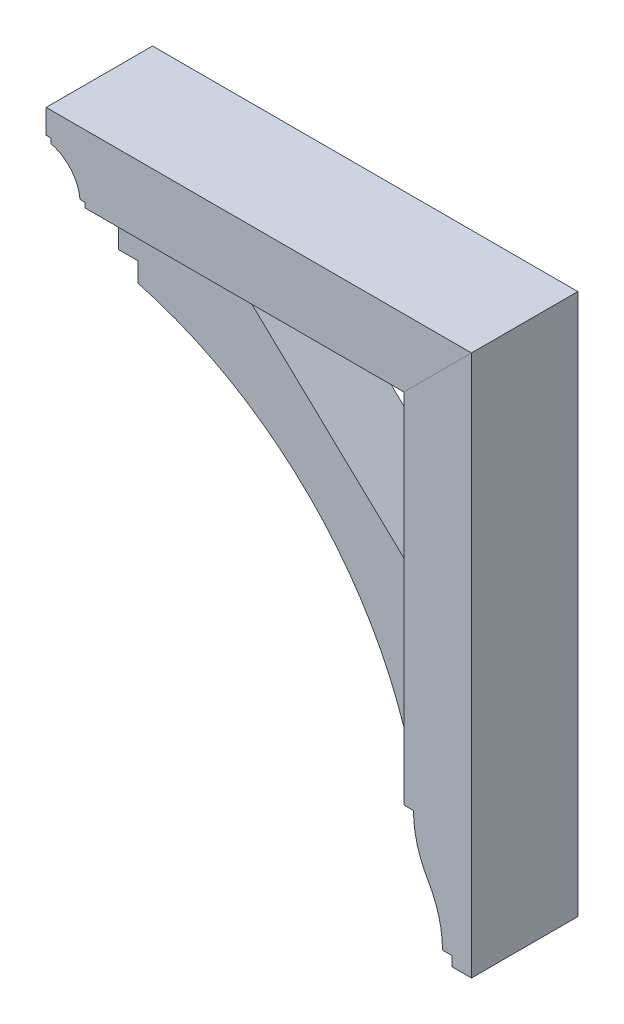
ISO-10303-21;
HEADER;
FILE_DESCRIPTION(('STEP AP214'),'2;1');
FILE_NAME('part.step','',(''),(''),'','','');
FILE_SCHEMA(('AUTOMOTIVE_DESIGN { 1 0 10303 214 1 1 1 1 }'));
ENDSEC;
DATA;
#1=APPLICATION_CONTEXT('core data for automotive mechanical design processes');
#2=APPLICATION_PROTOCOL_DEFINITION('international standard','automotive_design',2000,#1);
#3=PRODUCT_CONTEXT('',#1,'mechanical');
#4=PRODUCT('Part','Part','',(#3));
#5=PRODUCT_RELATED_PRODUCT_CATEGORY('part','',(#4));
#6=PRODUCT_DEFINITION_FORMATION('','',#4);
#7=PRODUCT_DEFINITION_CONTEXT('part definition',#1,'design');
#8=PRODUCT_DEFINITION('design','',#6,#7);
#9=PRODUCT_DEFINITION_SHAPE('','',#8);
#10=(LENGTH_UNIT() NAMED_UNIT(*) SI_UNIT(.MILLI.,.METRE.));
#11=(NAMED_UNIT(*) PLANE_ANGLE_UNIT() SI_UNIT($,.RADIAN.));
#12=(NAMED_UNIT(*) SI_UNIT($,.STERADIAN.) SOLID_ANGLE_UNIT());
#13=UNCERTAINTY_MEASURE_WITH_UNIT(LENGTH_MEASURE(1.E-05),#10,'distance_accuracy_value','');
#14=(GEOMETRIC_REPRESENTATION_CONTEXT(3) GLOBAL_UNCERTAINTY_ASSIGNED_CONTEXT((#13)) GLOBAL_UNIT_ASSIGNED_CONTEXT((#10,
#11,#12)) REPRESENTATION_CONTEXT('',''));
#15=CARTESIAN_POINT('',(0.,0.,0.));
#16=DIRECTION('',(0.,0.,1.));
#17=DIRECTION('',(1.,0.,0.));
#18=AXIS2_PLACEMENT_3D('',#15,#16,#17);
#19=CARTESIAN_POINT('',(384.591211656338,-183.515,69.85));
#20=DIRECTION('',(0.,0.,-1.));
#21=DIRECTION('',(-1.,0.,0.));
#22=AXIS2_PLACEMENT_3D('',#19,#20,#21);
#23=CYLINDRICAL_SURFACE('',#22,137.709988640782);
#24=CARTESIAN_POINT('',(384.591211656338,-183.515,-69.85));
#25=DIRECTION('',(0.,0.,1.));
#26=DIRECTION('',(1.,0.,0.));
#27=AXIS2_PLACEMENT_3D('',#24,#25,#26);
#28=CIRCLE('',#27,137.709988640782);
#29=CARTESIAN_POINT('',(265.948759904279,-253.429301925319,-69.85));
#30=VERTEX_POINT('',#29);
#31=CARTESIAN_POINT('',(246.881223015556,-183.515,-69.85));
#32=VERTEX_POINT('',#31);
#33=EDGE_CURVE('E150',#30,#32,#28,.F.);
#34=ORIENTED_EDGE('',*,*,#33,.F.);
#35=DIRECTION('',(0.,0.,-1.));
#36=VECTOR('',#35,1.);
#37=CARTESIAN_POINT('',(265.948759904279,-253.429301925319,69.85));
#38=LINE('',#37,#36);
#39=CARTESIAN_POINT('',(265.948759904279,-253.429301925319,69.85));
#40=VERTEX_POINT('',#39);
#41=EDGE_CURVE('E12',#40,#30,#38,.T.);
#42=ORIENTED_EDGE('',*,*,#41,.F.);
#43=CARTESIAN_POINT('',(384.591211656338,-183.515,69.85));
#44=DIRECTION('',(0.,0.,1.));
#45=DIRECTION('',(1.,0.,0.));
#46=AXIS2_PLACEMENT_3D('',#43,#44,#45);
#47=CIRCLE('',#46,137.709988640782);
#48=CARTESIAN_POINT('',(246.881223015556,-183.515,69.85));
#49=VERTEX_POINT('',#48);
#50=EDGE_CURVE('E171',#40,#49,#47,.F.);
#51=ORIENTED_EDGE('',*,*,#50,.T.);
#52=DIRECTION('',(0.,0.,-1.));
#53=VECTOR('',#52,1.);
#54=CARTESIAN_POINT('',(246.881223015556,-183.515,69.85));
#55=LINE('',#54,#53);
#56=EDGE_CURVE('E105',#49,#32,#55,.T.);
#57=ORIENTED_EDGE('',*,*,#56,.T.);
#58=EDGE_LOOP('',(#34,#42,#51,#57));
#59=FACE_BOUND('',#58,.T.);
#60=ADVANCED_FACE('F51',(#59),#23,.T.);
#61=CARTESIAN_POINT('',(147.524544989665,-323.215,69.85));
#62=DIRECTION('',(0.,0.,-1.));
#63=DIRECTION('',(-1.,0.,0.));
#64=AXIS2_PLACEMENT_3D('',#61,#62,#63);
#65=CYLINDRICAL_SURFACE('',#64,137.45667802589);
#66=CARTESIAN_POINT('',(147.524544989665,-323.215,-69.85));
#67=DIRECTION('',(0.,0.,1.));
#68=DIRECTION('',(1.,0.,0.));
#69=AXIS2_PLACEMENT_3D('',#66,#67,#68);
#70=CIRCLE('',#69,137.45667802589);
#71=CARTESIAN_POINT('',(284.981223015555,-323.215,-69.85));
#72=VERTEX_POINT('',#71);
#73=EDGE_CURVE('E153',#72,#30,#70,.T.);
#74=ORIENTED_EDGE('',*,*,#73,.F.);
#75=DIRECTION('',(0.,0.,-1.));
#76=VECTOR('',#75,1.);
#77=CARTESIAN_POINT('',(284.981223015555,-323.215,69.85));
#78=LINE('',#77,#76);
#79=CARTESIAN_POINT('',(284.981223015555,-323.215,69.85));
#80=VERTEX_POINT('',#79);
#81=EDGE_CURVE('E59',#80,#72,#78,.T.);
#82=ORIENTED_EDGE('',*,*,#81,.F.);
#83=CARTESIAN_POINT('',(147.524544989665,-323.215,69.85));
#84=DIRECTION('',(0.,0.,1.));
#85=DIRECTION('',(1.,0.,0.));
#86=AXIS2_PLACEMENT_3D('',#83,#84,#85);
#87=CIRCLE('',#86,137.45667802589);
#88=EDGE_CURVE('E202',#80,#40,#87,.T.);
#89=ORIENTED_EDGE('',*,*,#88,.T.);
#90=ORIENTED_EDGE('',*,*,#41,.T.);
#91=EDGE_LOOP('',(#74,#82,#89,#90));
#92=FACE_BOUND('',#91,.T.);
#93=ADVANCED_FACE('F190',(#92),#65,.F.);
#94=CARTESIAN_POINT('',(0.,-323.215,69.85));
#95=DIRECTION('',(0.,-1.,0.));
#96=DIRECTION('',(0.,0.,-1.));
#97=AXIS2_PLACEMENT_3D('',#94,#95,#96);
#98=PLANE('',#97);
#99=DIRECTION('',(-1.,0.,0.));
#100=VECTOR('',#99,1.);
#101=CARTESIAN_POINT('',(0.,-323.215,-69.85));
#102=LINE('',#101,#100);
#103=CARTESIAN_POINT('',(297.681223015555,-323.215,-69.85));
#104=VERTEX_POINT('',#103);
#105=EDGE_CURVE('E156',#104,#72,#102,.T.);
#106=ORIENTED_EDGE('',*,*,#105,.F.);
#107=DIRECTION('',(0.,0.,-1.));
#108=VECTOR('',#107,1.);
#109=CARTESIAN_POINT('',(297.681223015555,-323.215,69.85));
#110=LINE('',#109,#108);
#111=CARTESIAN_POINT('',(297.681223015555,-323.215,69.85));
#112=VERTEX_POINT('',#111);
#113=EDGE_CURVE('E179',#112,#104,#110,.T.);
#114=ORIENTED_EDGE('',*,*,#113,.F.);
#115=DIRECTION('',(-1.,0.,0.));
#116=VECTOR('',#115,1.);
#117=CARTESIAN_POINT('',(0.,-323.215,69.85));
#118=LINE('',#117,#116);
#119=EDGE_CURVE('E186',#112,#80,#118,.T.);
#120=ORIENTED_EDGE('',*,*,#119,.T.);
#121=ORIENTED_EDGE('',*,*,#81,.T.);
#122=EDGE_LOOP('',(#106,#114,#120,#121));
#123=FACE_BOUND('',#122,.T.);
#124=ADVANCED_FACE('F184',(#123),#98,.T.);
#125=CARTESIAN_POINT('',(297.681223015555,0.,69.85));
#126=DIRECTION('',(-1.,0.,0.));
#127=DIRECTION('',(0.,0.,1.));
#128=AXIS2_PLACEMENT_3D('',#125,#126,#127);
#129=PLANE('',#128);
#130=DIRECTION('',(0.,1.,0.));
#131=VECTOR('',#130,1.);
#132=CARTESIAN_POINT('',(297.681223015555,0.,-69.85));
#133=LINE('',#132,#131);
#134=CARTESIAN_POINT('',(297.681223015555,-335.915,-69.85));
#135=VERTEX_POINT('',#134);
#136=EDGE_CURVE('E159',#135,#104,#133,.T.);
#137=ORIENTED_EDGE('',*,*,#136,.F.);
#138=DIRECTION('',(0.,0.,-1.));
#139=VECTOR('',#138,1.);
#140=CARTESIAN_POINT('',(297.681223015555,-335.915,69.85));
#141=LINE('',#140,#139);
#142=CARTESIAN_POINT('',(297.681223015555,-335.915,69.85));
#143=VERTEX_POINT('',#142);
#144=EDGE_CURVE('E177',#143,#135,#141,.T.);
#145=ORIENTED_EDGE('',*,*,#144,.F.);
#146=DIRECTION('',(0.,1.,0.));
#147=VECTOR('',#146,1.);
#148=CARTESIAN_POINT('',(297.681223015555,0.,69.85));
#149=LINE('',#148,#147);
#150=EDGE_CURVE('E200',#143,#112,#149,.T.);
#151=ORIENTED_EDGE('',*,*,#150,.T.);
#152=ORIENTED_EDGE('',*,*,#113,.T.);
#153=EDGE_LOOP('',(#137,#145,#151,#152));
#154=FACE_BOUND('',#153,.T.);
#155=ADVANCED_FACE('F197',(#154),#129,.T.);
#156=CARTESIAN_POINT('',(-7.34134975033384E-13,-335.914999999999,69.85));
#157=DIRECTION('',(0.,-1.,0.));
#158=DIRECTION('',(1.,0.,0.));
#159=AXIS2_PLACEMENT_3D('',#156,#157,#158);
#160=PLANE('',#159);
#161=DIRECTION('',(-1.,0.,0.));
#162=VECTOR('',#161,1.);
#163=CARTESIAN_POINT('',(-7.34134975033384E-13,-335.914999999999,-69.85));
#164=LINE('',#163,#162);
#165=CARTESIAN_POINT('',(323.081223015555,-335.915,-69.85));
#166=VERTEX_POINT('',#165);
#167=EDGE_CURVE('E162',#166,#135,#164,.T.);
#168=ORIENTED_EDGE('',*,*,#167,.F.);
#169=DIRECTION('',(0.,0.,-1.));
#170=VECTOR('',#169,1.);
#171=CARTESIAN_POINT('',(323.081223015555,-335.915,69.85));
#172=LINE('',#171,#170);
#173=CARTESIAN_POINT('',(323.081223015555,-335.915,69.85));
#174=VERTEX_POINT('',#173);
#175=EDGE_CURVE('E175',#174,#166,#172,.T.);
#176=ORIENTED_EDGE('',*,*,#175,.F.);
#177=DIRECTION('',(-1.,0.,0.));
#178=VECTOR('',#177,1.);
#179=CARTESIAN_POINT('',(-7.34134975033384E-13,-335.914999999999,69.85));
#180=LINE('',#179,#178);
#181=EDGE_CURVE('E204',#174,#143,#180,.T.);
#182=ORIENTED_EDGE('',*,*,#181,.T.);
#183=ORIENTED_EDGE('',*,*,#144,.T.);
#184=EDGE_LOOP('',(#168,#176,#182,#183));
#185=FACE_BOUND('',#184,.T.);
#186=ADVANCED_FACE('F210',(#185),#160,.T.);
#187=CARTESIAN_POINT('',(323.081223015555,0.,69.85));
#188=DIRECTION('',(-1.,0.,0.));
#189=DIRECTION('',(0.,-1.,0.));
#190=AXIS2_PLACEMENT_3D('',#187,#188,#189);
#191=PLANE('',#190);
#192=DIRECTION('',(0.,1.,0.));
#193=VECTOR('',#192,1.);
#194=CARTESIAN_POINT('',(323.081223015555,0.,-69.85));
#195=LINE('',#194,#193);
#196=CARTESIAN_POINT('',(323.081223015555,375.285,-69.85));
#197=VERTEX_POINT('',#196);
#198=EDGE_CURVE('E165',#166,#197,#195,.T.);
#199=ORIENTED_EDGE('',*,*,#198,.T.);
#200=DIRECTION('',(0.,0.,-1.));
#201=VECTOR('',#200,1.);
#202=CARTESIAN_POINT('',(323.081223015555,375.285,69.85));
#203=LINE('',#202,#201);
#204=CARTESIAN_POINT('',(323.081223015555,375.285,69.85));
#205=VERTEX_POINT('',#204);
#206=EDGE_CURVE('E142',#205,#197,#203,.T.);
#207=ORIENTED_EDGE('',*,*,#206,.F.);
#208=DIRECTION('',(0.,1.,0.));
#209=VECTOR('',#208,1.);
#210=CARTESIAN_POINT('',(323.081223015555,0.,69.85));
#211=LINE('',#210,#209);
#212=EDGE_CURVE('E133',#174,#205,#211,.T.);
#213=ORIENTED_EDGE('',*,*,#212,.F.);
#214=ORIENTED_EDGE('',*,*,#175,.T.);
#215=EDGE_LOOP('',(#199,#207,#213,#214));
#216=FACE_BOUND('',#215,.T.);
#217=ADVANCED_FACE('F212',(#216),#191,.F.);
#218=CARTESIAN_POINT('',(-26.1018884922204,26.1018884922201,69.85));
#219=DIRECTION('',(0.707106781186552,-0.707106781186543,0.));
#220=DIRECTION('',(0.707106781186543,0.707106781186552,0.));
#221=AXIS2_PLACEMENT_3D('',#218,#219,#220);
#222=PLANE('',#221);
#223=DIRECTION('',(-0.707106781186543,-0.707106781186552,0.));
#224=VECTOR('',#223,1.);
#225=CARTESIAN_POINT('',(-26.1018884922204,26.1018884922201,-69.85));
#226=LINE('',#225,#224);
#227=CARTESIAN_POINT('',(234.181223015556,286.385,-69.85));
#228=VERTEX_POINT('',#227);
#229=EDGE_CURVE('E141',#197,#228,#226,.T.);
#230=ORIENTED_EDGE('',*,*,#229,.T.);
#231=DIRECTION('',(0.,0.,-1.));
#232=VECTOR('',#231,1.);
#233=CARTESIAN_POINT('',(234.181223015556,286.385,69.85));
#234=LINE('',#233,#232);
#235=CARTESIAN_POINT('',(234.181223015556,286.385,69.85));
#236=VERTEX_POINT('',#235);
#237=EDGE_CURVE('E138',#236,#228,#234,.T.);
#238=ORIENTED_EDGE('',*,*,#237,.F.);
#239=DIRECTION('',(-0.707106781186543,-0.707106781186552,0.));
#240=VECTOR('',#239,1.);
#241=CARTESIAN_POINT('',(-26.1018884922204,26.1018884922201,69.85));
#242=LINE('',#241,#240);
#243=EDGE_CURVE('E126',#205,#236,#242,.T.);
#244=ORIENTED_EDGE('',*,*,#243,.F.);
#245=ORIENTED_EDGE('',*,*,#206,.T.);
#246=EDGE_LOOP('',(#230,#238,#244,#245));
#247=FACE_BOUND('',#246,.T.);
#248=ADVANCED_FACE('F139',(#247),#222,.F.);
#249=CARTESIAN_POINT('',(234.181223015556,0.,69.85));
#250=DIRECTION('',(1.,0.,0.));
#251=DIRECTION('',(0.,1.,0.));
#252=AXIS2_PLACEMENT_3D('',#249,#250,#251);
#253=PLANE('',#252);
#254=DIRECTION('',(0.,-1.,0.));
#255=VECTOR('',#254,1.);
#256=CARTESIAN_POINT('',(234.181223015556,0.,-69.85));
#257=LINE('',#256,#255);
#258=CARTESIAN_POINT('',(234.181223015556,-183.515,-69.85));
#259=VERTEX_POINT('',#258);
#260=EDGE_CURVE('E98',#228,#259,#257,.T.);
#261=ORIENTED_EDGE('',*,*,#260,.T.);
#262=DIRECTION('',(0.,0.,-1.));
#263=VECTOR('',#262,1.);
#264=CARTESIAN_POINT('',(234.181223015556,-183.515,69.85));
#265=LINE('',#264,#263);
#266=CARTESIAN_POINT('',(234.181223015556,-183.515,69.85));
#267=VERTEX_POINT('',#266);
#268=EDGE_CURVE('E143',#267,#259,#265,.T.);
#269=ORIENTED_EDGE('',*,*,#268,.F.);
#270=DIRECTION('',(0.,-1.,0.));
#271=VECTOR('',#270,1.);
#272=CARTESIAN_POINT('',(234.181223015556,0.,69.85));
#273=LINE('',#272,#271);
#274=EDGE_CURVE('E130',#236,#267,#273,.T.);
#275=ORIENTED_EDGE('',*,*,#274,.F.);
#276=ORIENTED_EDGE('',*,*,#237,.T.);
#277=EDGE_LOOP('',(#261,#269,#275,#276));
#278=FACE_BOUND('',#277,.T.);
#279=ADVANCED_FACE('F145',(#278),#253,.F.);
#280=CARTESIAN_POINT('',(0.,-183.515,69.85));
#281=DIRECTION('',(0.,1.,0.));
#282=DIRECTION('',(0.,0.,1.));
#283=AXIS2_PLACEMENT_3D('',#280,#281,#282);
#284=PLANE('',#283);
#285=DIRECTION('',(1.,0.,0.));
#286=VECTOR('',#285,1.);
#287=CARTESIAN_POINT('',(0.,-183.515,-69.85));
#288=LINE('',#287,#286);
#289=EDGE_CURVE('E169',#259,#32,#288,.T.);
#290=ORIENTED_EDGE('',*,*,#289,.T.);
#291=ORIENTED_EDGE('',*,*,#56,.F.);
#292=DIRECTION('',(1.,0.,0.));
#293=VECTOR('',#292,1.);
#294=CARTESIAN_POINT('',(0.,-183.515,69.85));
#295=LINE('',#294,#293);
#296=EDGE_CURVE('E67',#267,#49,#295,.T.);
#297=ORIENTED_EDGE('',*,*,#296,.F.);
#298=ORIENTED_EDGE('',*,*,#268,.T.);
#299=EDGE_LOOP('',(#290,#291,#297,#298));
#300=FACE_BOUND('',#299,.T.);
#301=ADVANCED_FACE('F215',(#300),#284,.F.);
#302=CARTESIAN_POINT('',(0.,0.,69.85));
#303=DIRECTION('',(0.,0.,1.));
#304=DIRECTION('',(1.,0.,0.));
#305=AXIS2_PLACEMENT_3D('',#302,#303,#304);
#306=PLANE('',#305);
#307=ORIENTED_EDGE('',*,*,#50,.F.);
#308=ORIENTED_EDGE('',*,*,#88,.F.);
#309=ORIENTED_EDGE('',*,*,#119,.F.);
#310=ORIENTED_EDGE('',*,*,#150,.F.);
#311=ORIENTED_EDGE('',*,*,#181,.F.);
#312=ORIENTED_EDGE('',*,*,#212,.T.);
#313=ORIENTED_EDGE('',*,*,#243,.T.);
#314=ORIENTED_EDGE('',*,*,#274,.T.);
#315=ORIENTED_EDGE('',*,*,#296,.T.);
#316=EDGE_LOOP('',(#307,#308,#309,#310,#311,#312,#313,#314,#315));
#317=FACE_BOUND('',#316,.T.);
#318=ADVANCED_FACE('F128',(#317),#306,.T.);
#319=CARTESIAN_POINT('',(0.,0.,-69.85));
#320=DIRECTION('',(0.,0.,1.));
#321=DIRECTION('',(1.,0.,0.));
#322=AXIS2_PLACEMENT_3D('',#319,#320,#321);
#323=PLANE('',#322);
#324=ORIENTED_EDGE('',*,*,#33,.T.);
#325=ORIENTED_EDGE('',*,*,#289,.F.);
#326=ORIENTED_EDGE('',*,*,#260,.F.);
#327=ORIENTED_EDGE('',*,*,#229,.F.);
#328=ORIENTED_EDGE('',*,*,#198,.F.);
#329=ORIENTED_EDGE('',*,*,#167,.T.);
#330=ORIENTED_EDGE('',*,*,#136,.T.);
#331=ORIENTED_EDGE('',*,*,#105,.T.);
#332=ORIENTED_EDGE('',*,*,#73,.T.);
#333=EDGE_LOOP('',(#324,#325,#326,#327,#328,#329,#330,#331,#332));
#334=FACE_BOUND('',#333,.T.);
#335=ADVANCED_FACE('F192',(#334),#323,.F.);
#336=CLOSED_SHELL('',(#60,#93,#124,#155,#186,#217,#248,#279,#301,#318,#335));
#337=MANIFOLD_SOLID_BREP('B2',#336);
#338=CARTESIAN_POINT('',(-140.468776984445,0.,44.45));
#339=DIRECTION('',(1.,0.,0.));
#340=DIRECTION('',(0.,0.,-1.));
#341=AXIS2_PLACEMENT_3D('',#338,#339,#340);
#342=PLANE('',#341);
#343=DIRECTION('',(0.,-1.,0.));
#344=VECTOR('',#343,1.);
#345=CARTESIAN_POINT('',(-140.468776984445,0.,-44.45));
#346=LINE('',#345,#344);
#347=CARTESIAN_POINT('',(-140.468776984445,235.585,-44.45));
#348=VERTEX_POINT('',#347);
#349=CARTESIAN_POINT('',(-140.468776984445,210.185,-44.45));
#350=VERTEX_POINT('',#349);
#351=EDGE_CURVE('E411',#348,#350,#346,.T.);
#352=ORIENTED_EDGE('',*,*,#351,.T.);
#353=DIRECTION('',(0.,0.,-1.));
#354=VECTOR('',#353,1.);
#355=CARTESIAN_POINT('',(-140.468776984445,210.185,44.45));
#356=LINE('',#355,#354);
#357=CARTESIAN_POINT('',(-140.468776984445,210.185,44.45));
#358=VERTEX_POINT('',#357);
#359=EDGE_CURVE('E49',#358,#350,#356,.T.);
#360=ORIENTED_EDGE('',*,*,#359,.F.);
#361=DIRECTION('',(0.,-1.,0.));
#362=VECTOR('',#361,1.);
#363=CARTESIAN_POINT('',(-140.468776984445,0.,44.45));
#364=LINE('',#363,#362);
#365=CARTESIAN_POINT('',(-140.468776984445,235.585,44.45));
#366=VERTEX_POINT('',#365);
#367=EDGE_CURVE('E429',#366,#358,#364,.T.);
#368=ORIENTED_EDGE('',*,*,#367,.F.);
#369=DIRECTION('',(0.,0.,-1.));
#370=VECTOR('',#369,1.);
#371=CARTESIAN_POINT('',(-140.468776984445,235.585,44.45));
#372=LINE('',#371,#370);
#373=EDGE_CURVE('E410',#366,#348,#372,.T.);
#374=ORIENTED_EDGE('',*,*,#373,.T.);
#375=EDGE_LOOP('',(#352,#360,#368,#374));
#376=FACE_BOUND('',#375,.T.);
#377=ADVANCED_FACE('F313',(#376),#342,.F.);
#378=CARTESIAN_POINT('',(-273.3242381875,-280.134718580156,44.45));
#379=DIRECTION('',(0.,0.,-1.));
#380=DIRECTION('',(-1.,0.,0.));
#381=AXIS2_PLACEMENT_3D('',#378,#379,#380);
#382=CYLINDRICAL_SURFACE('',#381,508.);
#383=CARTESIAN_POINT('',(-273.3242381875,-280.134718580156,-44.45));
#384=DIRECTION('',(0.,0.,1.));
#385=DIRECTION('',(1.,0.,0.));
#386=AXIS2_PLACEMENT_3D('',#383,#384,#385);
#387=CIRCLE('',#386,508.);
#388=CARTESIAN_POINT('',(208.781223015556,-120.015,-44.45));
#389=VERTEX_POINT('',#388);
#390=EDGE_CURVE('E414',#350,#389,#387,.F.);
#391=ORIENTED_EDGE('',*,*,#390,.T.);
#392=DIRECTION('',(0.,0.,-1.));
#393=VECTOR('',#392,1.);
#394=CARTESIAN_POINT('',(208.781223015556,-120.015,44.45));
#395=LINE('',#394,#393);
#396=CARTESIAN_POINT('',(208.781223015556,-120.015,44.45));
#397=VERTEX_POINT('',#396);
#398=EDGE_CURVE('E321',#397,#389,#395,.T.);
#399=ORIENTED_EDGE('',*,*,#398,.F.);
#400=CARTESIAN_POINT('',(-273.3242381875,-280.134718580156,44.45));
#401=DIRECTION('',(0.,0.,1.));
#402=DIRECTION('',(1.,0.,0.));
#403=AXIS2_PLACEMENT_3D('',#400,#401,#402);
#404=CIRCLE('',#403,508.);
#405=EDGE_CURVE('E371',#358,#397,#404,.F.);
#406=ORIENTED_EDGE('',*,*,#405,.F.);
#407=ORIENTED_EDGE('',*,*,#359,.T.);
#408=EDGE_LOOP('',(#391,#399,#406,#407));
#409=FACE_BOUND('',#408,.T.);
#410=ADVANCED_FACE('F442',(#409),#382,.F.);
#411=CARTESIAN_POINT('',(0.,-120.015,44.45));
#412=DIRECTION('',(0.,-1.,0.));
#413=DIRECTION('',(0.,0.,-1.));
#414=AXIS2_PLACEMENT_3D('',#411,#412,#413);
#415=PLANE('',#414);
#416=DIRECTION('',(-1.,0.,0.));
#417=VECTOR('',#416,1.);
#418=CARTESIAN_POINT('',(0.,-120.015,-44.45));
#419=LINE('',#418,#417);
#420=CARTESIAN_POINT('',(234.181223015556,-120.015,-44.45));
#421=VERTEX_POINT('',#420);
#422=EDGE_CURVE('E417',#421,#389,#419,.T.);
#423=ORIENTED_EDGE('',*,*,#422,.F.);
#424=DIRECTION('',(0.,0.,-1.));
#425=VECTOR('',#424,1.);
#426=CARTESIAN_POINT('',(234.181223015556,-120.015,44.45));
#427=LINE('',#426,#425);
#428=CARTESIAN_POINT('',(234.181223015556,-120.015,44.45));
#429=VERTEX_POINT('',#428);
#430=EDGE_CURVE('E435',#429,#421,#427,.T.);
#431=ORIENTED_EDGE('',*,*,#430,.F.);
#432=DIRECTION('',(-1.,0.,0.));
#433=VECTOR('',#432,1.);
#434=CARTESIAN_POINT('',(0.,-120.015,44.45));
#435=LINE('',#434,#433);
#436=EDGE_CURVE('E441',#429,#397,#435,.T.);
#437=ORIENTED_EDGE('',*,*,#436,.T.);
#438=ORIENTED_EDGE('',*,*,#398,.T.);
#439=EDGE_LOOP('',(#423,#431,#437,#438));
#440=FACE_BOUND('',#439,.T.);
#441=ADVANCED_FACE('F439',(#440),#415,.T.);
#442=CARTESIAN_POINT('',(234.181223015556,0.,44.45));
#443=DIRECTION('',(1.,0.,0.));
#444=DIRECTION('',(0.,1.,0.));
#445=AXIS2_PLACEMENT_3D('',#442,#443,#444);
#446=PLANE('',#445);
#447=DIRECTION('',(0.,-1.,0.));
#448=VECTOR('',#447,1.);
#449=CARTESIAN_POINT('',(234.181223015556,0.,-44.45));
#450=LINE('',#449,#448);
#451=CARTESIAN_POINT('',(234.181223015556,48.22444,-44.45));
#452=VERTEX_POINT('',#451);
#453=EDGE_CURVE('E420',#452,#421,#450,.T.);
#454=ORIENTED_EDGE('',*,*,#453,.F.);
#455=DIRECTION('',(0.,0.,-1.));
#456=VECTOR('',#455,1.);
#457=CARTESIAN_POINT('',(234.181223015556,48.22444,44.45));
#458=LINE('',#457,#456);
#459=CARTESIAN_POINT('',(234.181223015556,48.22444,44.45));
#460=VERTEX_POINT('',#459);
#461=EDGE_CURVE('E433',#460,#452,#458,.T.);
#462=ORIENTED_EDGE('',*,*,#461,.F.);
#463=DIRECTION('',(0.,-1.,0.));
#464=VECTOR('',#463,1.);
#465=CARTESIAN_POINT('',(234.181223015556,0.,44.45));
#466=LINE('',#465,#464);
#467=EDGE_CURVE('E405',#460,#429,#466,.T.);
#468=ORIENTED_EDGE('',*,*,#467,.T.);
#469=ORIENTED_EDGE('',*,*,#430,.T.);
#470=EDGE_LOOP('',(#454,#462,#468,#469));
#471=FACE_BOUND('',#470,.T.);
#472=ADVANCED_FACE('F450',(#471),#446,.T.);
#473=CARTESIAN_POINT('',(134.603639858608,142.370007458488,44.45));
#474=DIRECTION('',(0.687009412845263,0.726648516589697,0.));
#475=DIRECTION('',(-0.726648516589697,0.687009412845263,0.));
#476=AXIS2_PLACEMENT_3D('',#473,#474,#475);
#477=PLANE('',#476);
#478=DIRECTION('',(0.726648516589697,-0.687009412845263,0.));
#479=VECTOR('',#478,1.);
#480=CARTESIAN_POINT('',(134.603639858608,142.370007458488,-44.45));
#481=LINE('',#480,#479);
#482=CARTESIAN_POINT('',(-17.7207369844447,286.385,-44.45));
#483=VERTEX_POINT('',#482);
#484=EDGE_CURVE('E423',#483,#452,#481,.T.);
#485=ORIENTED_EDGE('',*,*,#484,.F.);
#486=DIRECTION('',(0.,0.,-1.));
#487=VECTOR('',#486,1.);
#488=CARTESIAN_POINT('',(-17.7207369844447,286.385,44.45));
#489=LINE('',#488,#487);
#490=CARTESIAN_POINT('',(-17.7207369844447,286.385,44.45));
#491=VERTEX_POINT('',#490);
#492=EDGE_CURVE('E393',#491,#483,#489,.T.);
#493=ORIENTED_EDGE('',*,*,#492,.F.);
#494=DIRECTION('',(0.726648516589697,-0.687009412845263,0.));
#495=VECTOR('',#494,1.);
#496=CARTESIAN_POINT('',(134.603639858608,142.370007458488,44.45));
#497=LINE('',#496,#495);
#498=EDGE_CURVE('E403',#491,#460,#497,.T.);
#499=ORIENTED_EDGE('',*,*,#498,.T.);
#500=ORIENTED_EDGE('',*,*,#461,.T.);
#501=EDGE_LOOP('',(#485,#493,#499,#500));
#502=FACE_BOUND('',#501,.T.);
#503=ADVANCED_FACE('F478',(#502),#477,.T.);
#504=CARTESIAN_POINT('',(0.,286.385,44.45));
#505=DIRECTION('',(0.,1.,0.));
#506=DIRECTION('',(-1.,0.,0.));
#507=AXIS2_PLACEMENT_3D('',#504,#505,#506);
#508=PLANE('',#507);
#509=DIRECTION('',(1.,0.,0.));
#510=VECTOR('',#509,1.);
#511=CARTESIAN_POINT('',(0.,286.385,-44.45));
#512=LINE('',#511,#510);
#513=CARTESIAN_POINT('',(-165.868776984445,286.385,-44.45));
#514=VERTEX_POINT('',#513);
#515=EDGE_CURVE('E392',#514,#483,#512,.T.);
#516=ORIENTED_EDGE('',*,*,#515,.F.);
#517=DIRECTION('',(0.,0.,-1.));
#518=VECTOR('',#517,1.);
#519=CARTESIAN_POINT('',(-165.868776984445,286.385,44.45));
#520=LINE('',#519,#518);
#521=CARTESIAN_POINT('',(-165.868776984445,286.385,44.45));
#522=VERTEX_POINT('',#521);
#523=EDGE_CURVE('E386',#522,#514,#520,.T.);
#524=ORIENTED_EDGE('',*,*,#523,.F.);
#525=DIRECTION('',(1.,0.,0.));
#526=VECTOR('',#525,1.);
#527=CARTESIAN_POINT('',(0.,286.385,44.45));
#528=LINE('',#527,#526);
#529=EDGE_CURVE('E390',#522,#491,#528,.T.);
#530=ORIENTED_EDGE('',*,*,#529,.T.);
#531=ORIENTED_EDGE('',*,*,#492,.T.);
#532=EDGE_LOOP('',(#516,#524,#530,#531));
#533=FACE_BOUND('',#532,.T.);
#534=ADVANCED_FACE('F388',(#533),#508,.T.);
#535=CARTESIAN_POINT('',(-165.868776984445,0.,44.45));
#536=DIRECTION('',(1.,0.,0.));
#537=DIRECTION('',(0.,0.,-1.));
#538=AXIS2_PLACEMENT_3D('',#535,#536,#537);
#539=PLANE('',#538);
#540=DIRECTION('',(0.,-1.,0.));
#541=VECTOR('',#540,1.);
#542=CARTESIAN_POINT('',(-165.868776984445,0.,-44.45));
#543=LINE('',#542,#541);
#544=CARTESIAN_POINT('',(-165.868776984445,235.585,-44.45));
#545=VERTEX_POINT('',#544);
#546=EDGE_CURVE('E357',#514,#545,#543,.T.);
#547=ORIENTED_EDGE('',*,*,#546,.T.);
#548=DIRECTION('',(0.,0.,-1.));
#549=VECTOR('',#548,1.);
#550=CARTESIAN_POINT('',(-165.868776984445,235.585,44.45));
#551=LINE('',#550,#549);
#552=CARTESIAN_POINT('',(-165.868776984445,235.585,44.45));
#553=VERTEX_POINT('',#552);
#554=EDGE_CURVE('E394',#553,#545,#551,.T.);
#555=ORIENTED_EDGE('',*,*,#554,.F.);
#556=DIRECTION('',(0.,-1.,0.));
#557=VECTOR('',#556,1.);
#558=CARTESIAN_POINT('',(-165.868776984445,0.,44.45));
#559=LINE('',#558,#557);
#560=EDGE_CURVE('E396',#522,#553,#559,.T.);
#561=ORIENTED_EDGE('',*,*,#560,.F.);
#562=ORIENTED_EDGE('',*,*,#523,.T.);
#563=EDGE_LOOP('',(#547,#555,#561,#562));
#564=FACE_BOUND('',#563,.T.);
#565=ADVANCED_FACE('F397',(#564),#539,.F.);
#566=CARTESIAN_POINT('',(0.,235.585,44.45));
#567=DIRECTION('',(0.,1.,0.));
#568=DIRECTION('',(0.,0.,1.));
#569=AXIS2_PLACEMENT_3D('',#566,#567,#568);
#570=PLANE('',#569);
#571=DIRECTION('',(1.,0.,0.));
#572=VECTOR('',#571,1.);
#573=CARTESIAN_POINT('',(0.,235.585,-44.45));
#574=LINE('',#573,#572);
#575=EDGE_CURVE('E363',#545,#348,#574,.T.);
#576=ORIENTED_EDGE('',*,*,#575,.T.);
#577=ORIENTED_EDGE('',*,*,#373,.F.);
#578=DIRECTION('',(1.,0.,0.));
#579=VECTOR('',#578,1.);
#580=CARTESIAN_POINT('',(0.,235.585,44.45));
#581=LINE('',#580,#579);
#582=EDGE_CURVE('E329',#553,#366,#581,.T.);
#583=ORIENTED_EDGE('',*,*,#582,.F.);
#584=ORIENTED_EDGE('',*,*,#554,.T.);
#585=EDGE_LOOP('',(#576,#577,#583,#584));
#586=FACE_BOUND('',#585,.T.);
#587=ADVANCED_FACE('F457',(#586),#570,.F.);
#588=CARTESIAN_POINT('',(0.,0.,44.45));
#589=DIRECTION('',(0.,0.,1.));
#590=DIRECTION('',(1.,0.,0.));
#591=AXIS2_PLACEMENT_3D('',#588,#589,#590);
#592=PLANE('',#591);
#593=ORIENTED_EDGE('',*,*,#367,.T.);
#594=ORIENTED_EDGE('',*,*,#405,.T.);
#595=ORIENTED_EDGE('',*,*,#436,.F.);
#596=ORIENTED_EDGE('',*,*,#467,.F.);
#597=ORIENTED_EDGE('',*,*,#498,.F.);
#598=ORIENTED_EDGE('',*,*,#529,.F.);
#599=ORIENTED_EDGE('',*,*,#560,.T.);
#600=ORIENTED_EDGE('',*,*,#582,.T.);
#601=EDGE_LOOP('',(#593,#594,#595,#596,#597,#598,#599,#600));
#602=FACE_BOUND('',#601,.T.);
#603=ADVANCED_FACE('F400',(#602),#592,.T.);
#604=CARTESIAN_POINT('',(0.,0.,-44.45));
#605=DIRECTION('',(0.,0.,1.));
#606=DIRECTION('',(1.,0.,0.));
#607=AXIS2_PLACEMENT_3D('',#604,#605,#606);
#608=PLANE('',#607);
#609=ORIENTED_EDGE('',*,*,#351,.F.);
#610=ORIENTED_EDGE('',*,*,#575,.F.);
#611=ORIENTED_EDGE('',*,*,#546,.F.);
#612=ORIENTED_EDGE('',*,*,#515,.T.);
#613=ORIENTED_EDGE('',*,*,#484,.T.);
#614=ORIENTED_EDGE('',*,*,#453,.T.);
#615=ORIENTED_EDGE('',*,*,#422,.T.);
#616=ORIENTED_EDGE('',*,*,#390,.F.);
#617=EDGE_LOOP('',(#609,#610,#611,#612,#613,#614,#615,#616));
#618=FACE_BOUND('',#617,.T.);
#619=ADVANCED_FACE('F446',(#618),#608,.F.);
#620=CLOSED_SHELL('',(#377,#410,#441,#472,#503,#534,#565,#587,#603,#619));
#621=MANIFOLD_SOLID_BREP('B6',#620);
#622=CARTESIAN_POINT('',(-229.368776984445,0.,69.85));
#623=DIRECTION('',(-1.,0.,0.));
#624=DIRECTION('',(0.,0.,1.));
#625=AXIS2_PLACEMENT_3D('',#622,#623,#624);
#626=PLANE('',#625);
#627=DIRECTION('',(0.,1.,0.));
#628=VECTOR('',#627,1.);
#629=CARTESIAN_POINT('',(-229.368776984445,0.,-69.85));
#630=LINE('',#629,#628);
#631=CARTESIAN_POINT('',(-229.368776984445,337.185,-69.85));
#632=VERTEX_POINT('',#631);
#633=CARTESIAN_POINT('',(-229.368776984445,343.535,-69.85));
#634=VERTEX_POINT('',#633);
#635=EDGE_CURVE('E639',#632,#634,#630,.T.);
#636=ORIENTED_EDGE('',*,*,#635,.F.);
#637=DIRECTION('',(0.,0.,-1.));
#638=VECTOR('',#637,1.);
#639=CARTESIAN_POINT('',(-229.368776984445,337.185,69.85));
#640=LINE('',#639,#638);
#641=CARTESIAN_POINT('',(-229.368776984445,337.185,69.85));
#642=VERTEX_POINT('',#641);
#643=EDGE_CURVE('E311',#642,#632,#640,.T.);
#644=ORIENTED_EDGE('',*,*,#643,.F.);
#645=DIRECTION('',(0.,1.,0.));
#646=VECTOR('',#645,1.);
#647=CARTESIAN_POINT('',(-229.368776984445,0.,69.85));
#648=LINE('',#647,#646);
#649=CARTESIAN_POINT('',(-229.368776984445,343.535,69.85));
#650=VERTEX_POINT('',#649);
#651=EDGE_CURVE('E662',#642,#650,#648,.T.);
#652=ORIENTED_EDGE('',*,*,#651,.T.);
#653=DIRECTION('',(0.,0.,-1.));
#654=VECTOR('',#653,1.);
#655=CARTESIAN_POINT('',(-229.368776984445,343.535,69.85));
#656=LINE('',#655,#654);
#657=EDGE_CURVE('E556',#650,#634,#656,.T.);
#658=ORIENTED_EDGE('',*,*,#657,.T.);
#659=EDGE_LOOP('',(#636,#644,#652,#658));
#660=FACE_BOUND('',#659,.T.);
#661=ADVANCED_FACE('F540',(#660),#626,.T.);
#662=CARTESIAN_POINT('',(-241.780101736883,287.993150212195,69.85));
#663=DIRECTION('',(0.,0.,-1.));
#664=DIRECTION('',(-1.,0.,0.));
#665=AXIS2_PLACEMENT_3D('',#662,#663,#664);
#666=CYLINDRICAL_SURFACE('',#665,50.7334117486338);
#667=CARTESIAN_POINT('',(-241.780101736883,287.993150212195,-69.85));
#668=DIRECTION('',(0.,0.,1.));
#669=DIRECTION('',(1.,0.,0.));
#670=AXIS2_PLACEMENT_3D('',#667,#668,#669);
#671=CIRCLE('',#670,50.7334117486338);
#672=CARTESIAN_POINT('',(-191.268776984445,292.735,-69.85));
#673=VERTEX_POINT('',#672);
#674=EDGE_CURVE('E641',#632,#673,#671,.F.);
#675=ORIENTED_EDGE('',*,*,#674,.T.);
#676=DIRECTION('',(0.,0.,-1.));
#677=VECTOR('',#676,1.);
#678=CARTESIAN_POINT('',(-191.268776984445,292.735,69.85));
#679=LINE('',#678,#677);
#680=CARTESIAN_POINT('',(-191.268776984445,292.735,69.85));
#681=VERTEX_POINT('',#680);
#682=EDGE_CURVE('E548',#681,#673,#679,.T.);
#683=ORIENTED_EDGE('',*,*,#682,.F.);
#684=CARTESIAN_POINT('',(-241.780101736883,287.993150212195,69.85));
#685=DIRECTION('',(0.,0.,1.));
#686=DIRECTION('',(1.,0.,0.));
#687=AXIS2_PLACEMENT_3D('',#684,#685,#686);
#688=CIRCLE('',#687,50.7334117486338);
#689=EDGE_CURVE('E691',#642,#681,#688,.F.);
#690=ORIENTED_EDGE('',*,*,#689,.F.);
#691=ORIENTED_EDGE('',*,*,#643,.T.);
#692=EDGE_LOOP('',(#675,#683,#690,#691));
#693=FACE_BOUND('',#692,.T.);
#694=ADVANCED_FACE('F680',(#693),#666,.F.);
#695=CARTESIAN_POINT('',(0.,292.735,69.85));
#696=DIRECTION('',(0.,-1.,0.));
#697=DIRECTION('',(0.,0.,-1.));
#698=AXIS2_PLACEMENT_3D('',#695,#696,#697);
#699=PLANE('',#698);
#700=DIRECTION('',(-1.,0.,0.));
#701=VECTOR('',#700,1.);
#702=CARTESIAN_POINT('',(0.,292.735,-69.85));
#703=LINE('',#702,#701);
#704=CARTESIAN_POINT('',(-184.918776984445,292.735,-69.85));
#705=VERTEX_POINT('',#704);
#706=EDGE_CURVE('E644',#705,#673,#703,.T.);
#707=ORIENTED_EDGE('',*,*,#706,.F.);
#708=DIRECTION('',(0.,0.,-1.));
#709=VECTOR('',#708,1.);
#710=CARTESIAN_POINT('',(-184.918776984445,292.735,69.85));
#711=LINE('',#710,#709);
#712=CARTESIAN_POINT('',(-184.918776984445,292.735,69.85));
#713=VERTEX_POINT('',#712);
#714=EDGE_CURVE('E670',#713,#705,#711,.T.);
#715=ORIENTED_EDGE('',*,*,#714,.F.);
#716=DIRECTION('',(-1.,0.,0.));
#717=VECTOR('',#716,1.);
#718=CARTESIAN_POINT('',(0.,292.735,69.85));
#719=LINE('',#718,#717);
#720=EDGE_CURVE('E677',#713,#681,#719,.T.);
#721=ORIENTED_EDGE('',*,*,#720,.T.);
#722=ORIENTED_EDGE('',*,*,#682,.T.);
#723=EDGE_LOOP('',(#707,#715,#721,#722));
#724=FACE_BOUND('',#723,.T.);
#725=ADVANCED_FACE('F675',(#724),#699,.T.);
#726=CARTESIAN_POINT('',(-184.918776984445,0.,69.85));
#727=DIRECTION('',(-1.,0.,0.));
#728=DIRECTION('',(0.,0.,1.));
#729=AXIS2_PLACEMENT_3D('',#726,#727,#728);
#730=PLANE('',#729);
#731=DIRECTION('',(0.,1.,0.));
#732=VECTOR('',#731,1.);
#733=CARTESIAN_POINT('',(-184.918776984445,0.,-69.85));
#734=LINE('',#733,#732);
#735=CARTESIAN_POINT('',(-184.918776984445,286.385,-69.85));
#736=VERTEX_POINT('',#735);
#737=EDGE_CURVE('E647',#736,#705,#734,.T.);
#738=ORIENTED_EDGE('',*,*,#737,.F.);
#739=DIRECTION('',(0.,0.,-1.));
#740=VECTOR('',#739,1.);
#741=CARTESIAN_POINT('',(-184.918776984445,286.385,69.85));
#742=LINE('',#741,#740);
#743=CARTESIAN_POINT('',(-184.918776984445,286.385,69.85));
#744=VERTEX_POINT('',#743);
#745=EDGE_CURVE('E668',#744,#736,#742,.T.);
#746=ORIENTED_EDGE('',*,*,#745,.F.);
#747=DIRECTION('',(0.,1.,0.));
#748=VECTOR('',#747,1.);
#749=CARTESIAN_POINT('',(-184.918776984445,0.,69.85));
#750=LINE('',#749,#748);
#751=EDGE_CURVE('E690',#744,#713,#750,.T.);
#752=ORIENTED_EDGE('',*,*,#751,.T.);
#753=ORIENTED_EDGE('',*,*,#714,.T.);
#754=EDGE_LOOP('',(#738,#746,#752,#753));
#755=FACE_BOUND('',#754,.T.);
#756=ADVANCED_FACE('F686',(#755),#730,.T.);
#757=CARTESIAN_POINT('',(0.,286.385,69.85));
#758=DIRECTION('',(0.,1.,0.));
#759=DIRECTION('',(-1.,0.,0.));
#760=AXIS2_PLACEMENT_3D('',#757,#758,#759);
#761=PLANE('',#760);
#762=DIRECTION('',(1.,0.,0.));
#763=VECTOR('',#762,1.);
#764=CARTESIAN_POINT('',(0.,286.385,-69.85));
#765=LINE('',#764,#763);
#766=CARTESIAN_POINT('',(234.181223015556,286.385,-69.85));
#767=VERTEX_POINT('',#766);
#768=EDGE_CURVE('E650',#736,#767,#765,.T.);
#769=ORIENTED_EDGE('',*,*,#768,.T.);
#770=DIRECTION('',(0.,0.,-1.));
#771=VECTOR('',#770,1.);
#772=CARTESIAN_POINT('',(234.181223015556,286.385,69.85));
#773=LINE('',#772,#771);
#774=CARTESIAN_POINT('',(234.181223015556,286.385,69.85));
#775=VERTEX_POINT('',#774);
#776=EDGE_CURVE('E666',#775,#767,#773,.T.);
#777=ORIENTED_EDGE('',*,*,#776,.F.);
#778=DIRECTION('',(1.,0.,0.));
#779=VECTOR('',#778,1.);
#780=CARTESIAN_POINT('',(0.,286.385,69.85));
#781=LINE('',#780,#779);
#782=EDGE_CURVE('E693',#744,#775,#781,.T.);
#783=ORIENTED_EDGE('',*,*,#782,.F.);
#784=ORIENTED_EDGE('',*,*,#745,.T.);
#785=EDGE_LOOP('',(#769,#777,#783,#784));
#786=FACE_BOUND('',#785,.T.);
#787=ADVANCED_FACE('F723',(#786),#761,.F.);
#788=CARTESIAN_POINT('',(-26.1018884922204,26.1018884922201,69.85));
#789=DIRECTION('',(0.707106781186552,-0.707106781186543,0.));
#790=DIRECTION('',(0.707106781186543,0.707106781186552,0.));
#791=AXIS2_PLACEMENT_3D('',#788,#789,#790);
#792=PLANE('',#791);
#793=DIRECTION('',(-0.707106781186543,-0.707106781186552,0.));
#794=VECTOR('',#793,1.);
#795=CARTESIAN_POINT('',(-26.1018884922204,26.1018884922201,-69.85));
#796=LINE('',#795,#794);
#797=CARTESIAN_POINT('',(323.081223015555,375.285,-69.85));
#798=VERTEX_POINT('',#797);
#799=EDGE_CURVE('E653',#798,#767,#796,.T.);
#800=ORIENTED_EDGE('',*,*,#799,.F.);
#801=DIRECTION('',(0.,0.,-1.));
#802=VECTOR('',#801,1.);
#803=CARTESIAN_POINT('',(323.081223015555,375.285,69.85));
#804=LINE('',#803,#802);
#805=CARTESIAN_POINT('',(323.081223015555,375.285,69.85));
#806=VERTEX_POINT('',#805);
#807=EDGE_CURVE('E631',#806,#798,#804,.T.);
#808=ORIENTED_EDGE('',*,*,#807,.F.);
#809=DIRECTION('',(-0.707106781186543,-0.707106781186552,0.));
#810=VECTOR('',#809,1.);
#811=CARTESIAN_POINT('',(-26.1018884922204,26.1018884922201,69.85));
#812=LINE('',#811,#810);
#813=EDGE_CURVE('E621',#806,#775,#812,.T.);
#814=ORIENTED_EDGE('',*,*,#813,.T.);
#815=ORIENTED_EDGE('',*,*,#776,.T.);
#816=EDGE_LOOP('',(#800,#808,#814,#815));
#817=FACE_BOUND('',#816,.T.);
#818=ADVANCED_FACE('F700',(#817),#792,.T.);
#819=CARTESIAN_POINT('',(0.,375.285,69.85));
#820=DIRECTION('',(0.,-1.,0.));
#821=DIRECTION('',(1.,0.,0.));
#822=AXIS2_PLACEMENT_3D('',#819,#820,#821);
#823=PLANE('',#822);
#824=DIRECTION('',(-1.,0.,0.));
#825=VECTOR('',#824,1.);
#826=CARTESIAN_POINT('',(0.,375.285,-69.85));
#827=LINE('',#826,#825);
#828=CARTESIAN_POINT('',(-235.718776984445,375.285,-69.85));
#829=VERTEX_POINT('',#828);
#830=EDGE_CURVE('E628',#798,#829,#827,.T.);
#831=ORIENTED_EDGE('',*,*,#830,.T.);
#832=DIRECTION('',(0.,0.,-1.));
#833=VECTOR('',#832,1.);
#834=CARTESIAN_POINT('',(-235.718776984445,375.285,69.85));
#835=LINE('',#834,#833);
#836=CARTESIAN_POINT('',(-235.718776984445,375.285,69.85));
#837=VERTEX_POINT('',#836);
#838=EDGE_CURVE('E625',#837,#829,#835,.T.);
#839=ORIENTED_EDGE('',*,*,#838,.F.);
#840=DIRECTION('',(-1.,0.,0.));
#841=VECTOR('',#840,1.);
#842=CARTESIAN_POINT('',(0.,375.285,69.85));
#843=LINE('',#842,#841);
#844=EDGE_CURVE('E613',#806,#837,#843,.T.);
#845=ORIENTED_EDGE('',*,*,#844,.F.);
#846=ORIENTED_EDGE('',*,*,#807,.T.);
#847=EDGE_LOOP('',(#831,#839,#845,#846));
#848=FACE_BOUND('',#847,.T.);
#849=ADVANCED_FACE('F626',(#848),#823,.F.);
#850=CARTESIAN_POINT('',(-235.718776984445,0.,69.85));
#851=DIRECTION('',(1.,0.,0.));
#852=DIRECTION('',(0.,0.,-1.));
#853=AXIS2_PLACEMENT_3D('',#850,#851,#852);
#854=PLANE('',#853);
#855=DIRECTION('',(0.,-1.,0.));
#856=VECTOR('',#855,1.);
#857=CARTESIAN_POINT('',(-235.718776984445,0.,-69.85));
#858=LINE('',#857,#856);
#859=CARTESIAN_POINT('',(-235.718776984445,343.535,-69.85));
#860=VERTEX_POINT('',#859);
#861=EDGE_CURVE('E657',#829,#860,#858,.T.);
#862=ORIENTED_EDGE('',*,*,#861,.T.);
#863=DIRECTION('',(0.,0.,-1.));
#864=VECTOR('',#863,1.);
#865=CARTESIAN_POINT('',(-235.718776984445,343.535,69.85));
#866=LINE('',#865,#864);
#867=CARTESIAN_POINT('',(-235.718776984445,343.535,69.85));
#868=VERTEX_POINT('',#867);
#869=EDGE_CURVE('E585',#868,#860,#866,.T.);
#870=ORIENTED_EDGE('',*,*,#869,.F.);
#871=DIRECTION('',(0.,-1.,0.));
#872=VECTOR('',#871,1.);
#873=CARTESIAN_POINT('',(-235.718776984445,0.,69.85));
#874=LINE('',#873,#872);
#875=EDGE_CURVE('E619',#837,#868,#874,.T.);
#876=ORIENTED_EDGE('',*,*,#875,.F.);
#877=ORIENTED_EDGE('',*,*,#838,.T.);
#878=EDGE_LOOP('',(#862,#870,#876,#877));
#879=FACE_BOUND('',#878,.T.);
#880=ADVANCED_FACE('F633',(#879),#854,.F.);
#881=CARTESIAN_POINT('',(3.00315328161103E-12,343.534999999998,69.85));
#882=DIRECTION('',(0.,-1.,0.));
#883=DIRECTION('',(1.,0.,0.));
#884=AXIS2_PLACEMENT_3D('',#881,#882,#883);
#885=PLANE('',#884);
#886=DIRECTION('',(-1.,0.,0.));
#887=VECTOR('',#886,1.);
#888=CARTESIAN_POINT('',(3.00315328161103E-12,343.534999999998,-69.85));
#889=LINE('',#888,#887);
#890=EDGE_CURVE('E659',#634,#860,#889,.T.);
#891=ORIENTED_EDGE('',*,*,#890,.F.);
#892=ORIENTED_EDGE('',*,*,#657,.F.);
#893=DIRECTION('',(-1.,0.,0.));
#894=VECTOR('',#893,1.);
#895=CARTESIAN_POINT('',(3.00315328161103E-12,343.534999999998,69.85));
#896=LINE('',#895,#894);
#897=EDGE_CURVE('E634',#650,#868,#896,.T.);
#898=ORIENTED_EDGE('',*,*,#897,.T.);
#899=ORIENTED_EDGE('',*,*,#869,.T.);
#900=EDGE_LOOP('',(#891,#892,#898,#899));
#901=FACE_BOUND('',#900,.T.);
#902=ADVANCED_FACE('F702',(#901),#885,.T.);
#903=CARTESIAN_POINT('',(0.,0.,69.85));
#904=DIRECTION('',(0.,0.,1.));
#905=DIRECTION('',(1.,0.,0.));
#906=AXIS2_PLACEMENT_3D('',#903,#904,#905);
#907=PLANE('',#906);
#908=ORIENTED_EDGE('',*,*,#651,.F.);
#909=ORIENTED_EDGE('',*,*,#689,.T.);
#910=ORIENTED_EDGE('',*,*,#720,.F.);
#911=ORIENTED_EDGE('',*,*,#751,.F.);
#912=ORIENTED_EDGE('',*,*,#782,.T.);
#913=ORIENTED_EDGE('',*,*,#813,.F.);
#914=ORIENTED_EDGE('',*,*,#844,.T.);
#915=ORIENTED_EDGE('',*,*,#875,.T.);
#916=ORIENTED_EDGE('',*,*,#897,.F.);
#917=EDGE_LOOP('',(#908,#909,#910,#911,#912,#913,#914,#915,#916));
#918=FACE_BOUND('',#917,.T.);
#919=ADVANCED_FACE('F616',(#918),#907,.T.);
#920=CARTESIAN_POINT('',(0.,0.,-69.85));
#921=DIRECTION('',(0.,0.,1.));
#922=DIRECTION('',(1.,0.,0.));
#923=AXIS2_PLACEMENT_3D('',#920,#921,#922);
#924=PLANE('',#923);
#925=ORIENTED_EDGE('',*,*,#635,.T.);
#926=ORIENTED_EDGE('',*,*,#890,.T.);
#927=ORIENTED_EDGE('',*,*,#861,.F.);
#928=ORIENTED_EDGE('',*,*,#830,.F.);
#929=ORIENTED_EDGE('',*,*,#799,.T.);
#930=ORIENTED_EDGE('',*,*,#768,.F.);
#931=ORIENTED_EDGE('',*,*,#737,.T.);
#932=ORIENTED_EDGE('',*,*,#706,.T.);
#933=ORIENTED_EDGE('',*,*,#674,.F.);
#934=EDGE_LOOP('',(#925,#926,#927,#928,#929,#930,#931,#932,#933));
#935=FACE_BOUND('',#934,.T.);
#936=ADVANCED_FACE('F682',(#935),#924,.F.);
#937=CLOSED_SHELL('',(#661,#694,#725,#756,#787,#818,#849,#880,#902,#919,#936));
#938=MANIFOLD_SOLID_BREP('B43',#937);
#939=ADVANCED_BREP_SHAPE_REPRESENTATION('',(#18,#337,#621,#938),#14);
#940=SHAPE_DEFINITION_REPRESENTATION(#9,#939);
ENDSEC;
END-ISO-10303-21;
